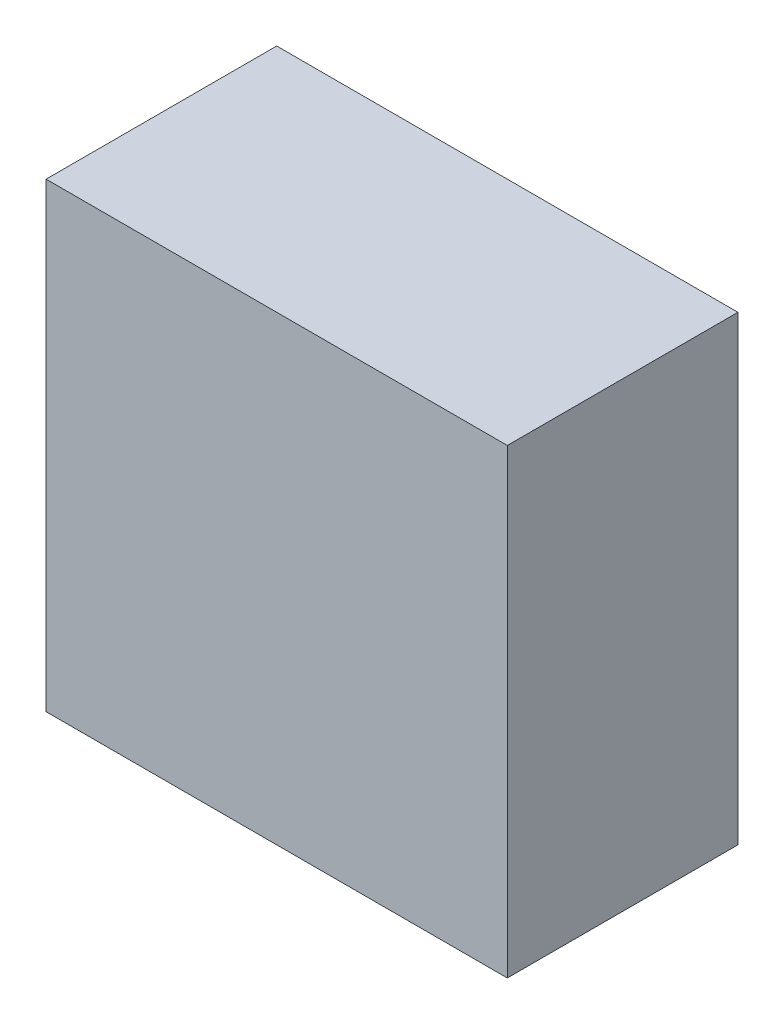
ISO-10303-21;
HEADER;
FILE_DESCRIPTION(('STEP AP214'),'2;1');
FILE_NAME('part.step','',(''),(''),'','','');
FILE_SCHEMA(('AUTOMOTIVE_DESIGN { 1 0 10303 214 1 1 1 1 }'));
ENDSEC;
DATA;
#1=APPLICATION_CONTEXT('core data for automotive mechanical design processes');
#2=APPLICATION_PROTOCOL_DEFINITION('international standard','automotive_design',2000,#1);
#3=PRODUCT_CONTEXT('',#1,'mechanical');
#4=PRODUCT('Part','Part','',(#3));
#5=PRODUCT_RELATED_PRODUCT_CATEGORY('part','',(#4));
#6=PRODUCT_DEFINITION_FORMATION('','',#4);
#7=PRODUCT_DEFINITION_CONTEXT('part definition',#1,'design');
#8=PRODUCT_DEFINITION('design','',#6,#7);
#9=PRODUCT_DEFINITION_SHAPE('','',#8);
#10=(LENGTH_UNIT() NAMED_UNIT(*) SI_UNIT(.MILLI.,.METRE.));
#11=(NAMED_UNIT(*) PLANE_ANGLE_UNIT() SI_UNIT($,.RADIAN.));
#12=(NAMED_UNIT(*) SI_UNIT($,.STERADIAN.) SOLID_ANGLE_UNIT());
#13=UNCERTAINTY_MEASURE_WITH_UNIT(LENGTH_MEASURE(1.E-05),#10,'distance_accuracy_value','');
#14=(GEOMETRIC_REPRESENTATION_CONTEXT(3) GLOBAL_UNCERTAINTY_ASSIGNED_CONTEXT((#13)) GLOBAL_UNIT_ASSIGNED_CONTEXT((#10,
#11,#12)) REPRESENTATION_CONTEXT('',''));
#15=CARTESIAN_POINT('',(0.,0.,0.));
#16=DIRECTION('',(0.,0.,1.));
#17=DIRECTION('',(1.,0.,0.));
#18=AXIS2_PLACEMENT_3D('',#15,#16,#17);
#19=CARTESIAN_POINT('',(0.,0.,2.75));
#20=DIRECTION('',(0.,0.,-1.));
#21=DIRECTION('',(-1.,0.,0.));
#22=AXIS2_PLACEMENT_3D('',#19,#20,#21);
#23=PLANE('',#22);
#24=DIRECTION('',(1.,0.,0.));
#25=VECTOR('',#24,1.);
#26=CARTESIAN_POINT('',(158.313158045854,152.929115844304,2.75));
#27=LINE('',#26,#25);
#28=CARTESIAN_POINT('',(158.313158045854,152.929115844304,2.75));
#29=VERTEX_POINT('',#28);
#30=CARTESIAN_POINT('',(154.313158045854,152.929115844304,2.75));
#31=VERTEX_POINT('',#30);
#32=EDGE_CURVE('E80',#29,#31,#27,.F.);
#33=ORIENTED_EDGE('',*,*,#32,.T.);
#34=DIRECTION('',(0.,1.,0.));
#35=VECTOR('',#34,1.);
#36=CARTESIAN_POINT('',(154.313158045854,152.929115844304,2.75));
#37=LINE('',#36,#35);
#38=CARTESIAN_POINT('',(154.313158045854,148.929115844304,2.75));
#39=VERTEX_POINT('',#38);
#40=EDGE_CURVE('E55',#31,#39,#37,.F.);
#41=ORIENTED_EDGE('',*,*,#40,.T.);
#42=DIRECTION('',(1.,0.,0.));
#43=VECTOR('',#42,1.);
#44=CARTESIAN_POINT('',(158.313158045854,148.929115844304,2.75));
#45=LINE('',#44,#43);
#46=CARTESIAN_POINT('',(158.313158045854,148.929115844304,2.75));
#47=VERTEX_POINT('',#46);
#48=EDGE_CURVE('E57',#39,#47,#45,.T.);
#49=ORIENTED_EDGE('',*,*,#48,.T.);
#50=DIRECTION('',(0.,1.,0.));
#51=VECTOR('',#50,1.);
#52=CARTESIAN_POINT('',(158.313158045854,152.929115844304,2.75));
#53=LINE('',#52,#51);
#54=EDGE_CURVE('E20',#47,#29,#53,.T.);
#55=ORIENTED_EDGE('',*,*,#54,.T.);
#56=EDGE_LOOP('',(#33,#41,#49,#55));
#57=FACE_BOUND('',#56,.T.);
#58=ADVANCED_FACE('F17',(#57),#23,.F.);
#59=CARTESIAN_POINT('',(158.313158045854,152.929115844304,2.75));
#60=DIRECTION('',(-1.,0.,0.));
#61=DIRECTION('',(0.,0.,1.));
#62=AXIS2_PLACEMENT_3D('',#59,#60,#61);
#63=PLANE('',#62);
#64=DIRECTION('',(0.,0.,-1.));
#65=VECTOR('',#64,1.);
#66=CARTESIAN_POINT('',(158.313158045854,152.929115844304,2.75));
#67=LINE('',#66,#65);
#68=CARTESIAN_POINT('',(158.313158045854,152.929115844304,0.75));
#69=VERTEX_POINT('',#68);
#70=EDGE_CURVE('E68',#69,#29,#67,.F.);
#71=ORIENTED_EDGE('',*,*,#70,.T.);
#72=ORIENTED_EDGE('',*,*,#54,.F.);
#73=DIRECTION('',(0.,0.,1.));
#74=VECTOR('',#73,1.);
#75=CARTESIAN_POINT('',(158.313158045854,148.929115844304,2.75));
#76=LINE('',#75,#74);
#77=CARTESIAN_POINT('',(158.313158045854,148.929115844304,0.75));
#78=VERTEX_POINT('',#77);
#79=EDGE_CURVE('E63',#47,#78,#76,.F.);
#80=ORIENTED_EDGE('',*,*,#79,.T.);
#81=DIRECTION('',(0.,1.,0.));
#82=VECTOR('',#81,1.);
#83=CARTESIAN_POINT('',(158.313158045854,0.,0.75));
#84=LINE('',#83,#82);
#85=EDGE_CURVE('E83',#69,#78,#84,.F.);
#86=ORIENTED_EDGE('',*,*,#85,.F.);
#87=EDGE_LOOP('',(#71,#72,#80,#86));
#88=FACE_BOUND('',#87,.T.);
#89=ADVANCED_FACE('F65',(#88),#63,.F.);
#90=CARTESIAN_POINT('',(158.313158045854,148.929115844304,2.75));
#91=DIRECTION('',(0.,1.,0.));
#92=DIRECTION('',(0.,0.,1.));
#93=AXIS2_PLACEMENT_3D('',#90,#91,#92);
#94=PLANE('',#93);
#95=ORIENTED_EDGE('',*,*,#79,.F.);
#96=ORIENTED_EDGE('',*,*,#48,.F.);
#97=DIRECTION('',(0.,0.,-1.));
#98=VECTOR('',#97,1.);
#99=CARTESIAN_POINT('',(154.313158045854,148.929115844304,2.75));
#100=LINE('',#99,#98);
#101=CARTESIAN_POINT('',(154.313158045854,148.929115844304,0.75));
#102=VERTEX_POINT('',#101);
#103=EDGE_CURVE('E75',#39,#102,#100,.T.);
#104=ORIENTED_EDGE('',*,*,#103,.T.);
#105=DIRECTION('',(-1.,0.,0.));
#106=VECTOR('',#105,1.);
#107=CARTESIAN_POINT('',(0.,148.929115844304,0.75));
#108=LINE('',#107,#106);
#109=EDGE_CURVE('E72',#78,#102,#108,.T.);
#110=ORIENTED_EDGE('',*,*,#109,.F.);
#111=EDGE_LOOP('',(#95,#96,#104,#110));
#112=FACE_BOUND('',#111,.T.);
#113=ADVANCED_FACE('F70',(#112),#94,.F.);
#114=CARTESIAN_POINT('',(154.313158045854,152.929115844304,2.75));
#115=DIRECTION('',(1.,0.,0.));
#116=DIRECTION('',(0.,0.,-1.));
#117=AXIS2_PLACEMENT_3D('',#114,#115,#116);
#118=PLANE('',#117);
#119=ORIENTED_EDGE('',*,*,#103,.F.);
#120=ORIENTED_EDGE('',*,*,#40,.F.);
#121=DIRECTION('',(0.,0.,-1.));
#122=VECTOR('',#121,1.);
#123=CARTESIAN_POINT('',(154.313158045854,152.929115844304,2.75));
#124=LINE('',#123,#122);
#125=CARTESIAN_POINT('',(154.313158045854,152.929115844304,0.75));
#126=VERTEX_POINT('',#125);
#127=EDGE_CURVE('E35',#31,#126,#124,.T.);
#128=ORIENTED_EDGE('',*,*,#127,.T.);
#129=DIRECTION('',(0.,1.,0.));
#130=VECTOR('',#129,1.);
#131=CARTESIAN_POINT('',(154.313158045854,0.,0.75));
#132=LINE('',#131,#130);
#133=EDGE_CURVE('E26',#102,#126,#132,.T.);
#134=ORIENTED_EDGE('',*,*,#133,.F.);
#135=EDGE_LOOP('',(#119,#120,#128,#134));
#136=FACE_BOUND('',#135,.T.);
#137=ADVANCED_FACE('F89',(#136),#118,.F.);
#138=CARTESIAN_POINT('',(158.313158045854,152.929115844304,2.75));
#139=DIRECTION('',(0.,-1.,0.));
#140=DIRECTION('',(0.,0.,-1.));
#141=AXIS2_PLACEMENT_3D('',#138,#139,#140);
#142=PLANE('',#141);
#143=ORIENTED_EDGE('',*,*,#127,.F.);
#144=ORIENTED_EDGE('',*,*,#32,.F.);
#145=ORIENTED_EDGE('',*,*,#70,.F.);
#146=DIRECTION('',(-1.,0.,0.));
#147=VECTOR('',#146,1.);
#148=CARTESIAN_POINT('',(0.,152.929115844304,0.75));
#149=LINE('',#148,#147);
#150=EDGE_CURVE('E11',#126,#69,#149,.F.);
#151=ORIENTED_EDGE('',*,*,#150,.F.);
#152=EDGE_LOOP('',(#143,#144,#145,#151));
#153=FACE_BOUND('',#152,.T.);
#154=ADVANCED_FACE('F91',(#153),#142,.F.);
#155=CARTESIAN_POINT('',(0.,0.,0.75));
#156=DIRECTION('',(0.,0.,-1.));
#157=DIRECTION('',(-1.,0.,0.));
#158=AXIS2_PLACEMENT_3D('',#155,#156,#157);
#159=PLANE('',#158);
#160=ORIENTED_EDGE('',*,*,#133,.T.);
#161=ORIENTED_EDGE('',*,*,#150,.T.);
#162=ORIENTED_EDGE('',*,*,#85,.T.);
#163=ORIENTED_EDGE('',*,*,#109,.T.);
#164=EDGE_LOOP('',(#160,#161,#162,#163));
#165=FACE_BOUND('',#164,.T.);
#166=ADVANCED_FACE('F88',(#165),#159,.T.);
#167=CLOSED_SHELL('',(#58,#89,#113,#137,#154,#166));
#168=MANIFOLD_SOLID_BREP('B1',#167);
#169=ADVANCED_BREP_SHAPE_REPRESENTATION('',(#18,#168),#14);
#170=SHAPE_DEFINITION_REPRESENTATION(#9,#169);
ENDSEC;
END-ISO-10303-21;
